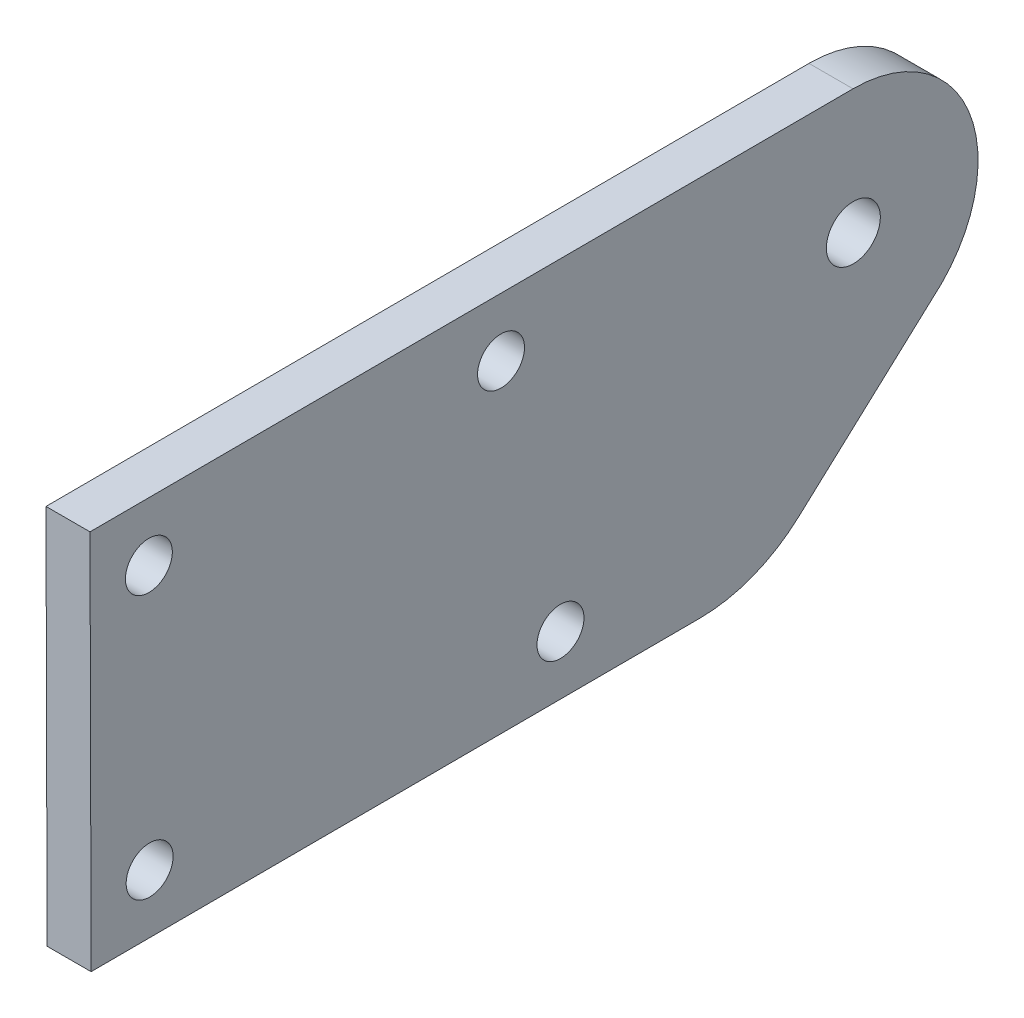
ISO-10303-21;
HEADER;
FILE_DESCRIPTION(('STEP AP214'),'2;1');
FILE_NAME('part.step','',(''),(''),'','','');
FILE_SCHEMA(('AUTOMOTIVE_DESIGN { 1 0 10303 214 1 1 1 1 }'));
ENDSEC;
DATA;
#1=APPLICATION_CONTEXT('core data for automotive mechanical design processes');
#2=APPLICATION_PROTOCOL_DEFINITION('international standard','automotive_design',2000,#1);
#3=PRODUCT_CONTEXT('',#1,'mechanical');
#4=PRODUCT('Part','Part','',(#3));
#5=PRODUCT_RELATED_PRODUCT_CATEGORY('part','',(#4));
#6=PRODUCT_DEFINITION_FORMATION('','',#4);
#7=PRODUCT_DEFINITION_CONTEXT('part definition',#1,'design');
#8=PRODUCT_DEFINITION('design','',#6,#7);
#9=PRODUCT_DEFINITION_SHAPE('','',#8);
#10=(LENGTH_UNIT() NAMED_UNIT(*) SI_UNIT(.MILLI.,.METRE.));
#11=(NAMED_UNIT(*) PLANE_ANGLE_UNIT() SI_UNIT($,.RADIAN.));
#12=(NAMED_UNIT(*) SI_UNIT($,.STERADIAN.) SOLID_ANGLE_UNIT());
#13=UNCERTAINTY_MEASURE_WITH_UNIT(LENGTH_MEASURE(1.E-05),#10,'distance_accuracy_value','');
#14=(GEOMETRIC_REPRESENTATION_CONTEXT(3) GLOBAL_UNCERTAINTY_ASSIGNED_CONTEXT((#13)) GLOBAL_UNIT_ASSIGNED_CONTEXT((#10,
#11,#12)) REPRESENTATION_CONTEXT('',''));
#15=CARTESIAN_POINT('',(0.,0.,0.));
#16=DIRECTION('',(0.,0.,1.));
#17=DIRECTION('',(1.,0.,0.));
#18=AXIS2_PLACEMENT_3D('',#15,#16,#17);
#19=CARTESIAN_POINT('',(3.,-0.106760715950999,-0.0387879175810517));
#20=DIRECTION('',(1.,0.,0.));
#21=DIRECTION('',(0.,0.,-1.));
#22=AXIS2_PLACEMENT_3D('',#19,#20,#21);
#23=PLANE('',#22);
#24=CARTESIAN_POINT('',(3.,-13.7446402422426,47.9222195992172));
#25=DIRECTION('',(1.,0.,0.));
#26=DIRECTION('',(0.,0.,-1.));
#27=AXIS2_PLACEMENT_3D('',#24,#25,#26);
#28=CIRCLE('',#27,1.59999999999998);
#29=CARTESIAN_POINT('',(3.,-13.7446402422426,46.3222195992172));
#30=VERTEX_POINT('',#29);
#31=EDGE_CURVE('E192',#30,#30,#28,.T.);
#32=ORIENTED_EDGE('',*,*,#31,.F.);
#33=EDGE_LOOP('',(#32));
#34=FACE_BOUND('',#33,.T.);
#35=CARTESIAN_POINT('',(3.,4.25528543675281,47.9739453243583));
#36=DIRECTION('',(1.,0.,0.));
#37=DIRECTION('',(0.,0.,-1.));
#38=AXIS2_PLACEMENT_3D('',#35,#36,#37);
#39=CIRCLE('',#38,1.60000000000002);
#40=CARTESIAN_POINT('',(3.,4.25528543675281,46.3739453243583));
#41=VERTEX_POINT('',#40);
#42=EDGE_CURVE('E204',#41,#41,#39,.T.);
#43=ORIENTED_EDGE('',*,*,#42,.F.);
#44=EDGE_LOOP('',(#43));
#45=FACE_BOUND('',#44,.T.);
#46=DIRECTION('',(0.,-0.00287365139677192,0.999995871055301));
#47=VECTOR('',#46,1.);
#48=CARTESIAN_POINT('',(3.,8.24377431538692,51.985423414167));
#49=LINE('',#48,#47);
#50=CARTESIAN_POINT('',(3.,8.39320418801906,-0.0143618807086011));
#51=VERTEX_POINT('',#50);
#52=CARTESIAN_POINT('',(3.,8.24377431538692,51.985423414167));
#53=VERTEX_POINT('',#52);
#54=EDGE_CURVE('E128',#51,#53,#49,.T.);
#55=ORIENTED_EDGE('',*,*,#54,.T.);
#56=DIRECTION('',(0.,-0.999995871055301,-0.00287365139675991));
#57=VECTOR('',#56,1.);
#58=CARTESIAN_POINT('',(3.,8.24377431538692,51.985423414167));
#59=LINE('',#58,#57);
#60=CARTESIAN_POINT('',(3.,-17.7561183320509,51.9107084778513));
#61=VERTEX_POINT('',#60);
#62=EDGE_CURVE('E86',#53,#61,#59,.T.);
#63=ORIENTED_EDGE('',*,*,#62,.T.);
#64=DIRECTION('',(0.,0.00287365139677199,-0.999995871055301));
#65=VECTOR('',#64,1.);
#66=CARTESIAN_POINT('',(3.,-17.7561183320509,51.9107084778513));
#67=LINE('',#66,#65);
#68=CARTESIAN_POINT('',(3.,-17.6368617990849,10.4108798290563));
#69=VERTEX_POINT('',#68);
#70=EDGE_CURVE('E99',#61,#69,#67,.T.);
#71=ORIENTED_EDGE('',*,*,#70,.T.);
#72=CARTESIAN_POINT('',(3.,-7.63690308853195,10.439616343024));
#73=DIRECTION('',(1.,0.,0.));
#74=DIRECTION('',(0.,0.,-1.));
#75=AXIS2_PLACEMENT_3D('',#72,#73,#74);
#76=CIRCLE('',#75,9.99999999999991);
#77=CARTESIAN_POINT('',(3.,-15.0193601103393,3.69429734973951));
#78=VERTEX_POINT('',#77);
#79=EDGE_CURVE('E93',#69,#78,#76,.T.);
#80=ORIENTED_EDGE('',*,*,#79,.T.);
#81=DIRECTION('',(0.,0.674531899328458,-0.738245702180746));
#82=VECTOR('',#81,1.);
#83=CARTESIAN_POINT('',(3.,-15.0193601103393,3.6942973497395));
#84=LINE('',#83,#82);
#85=CARTESIAN_POINT('',(3.,-6.11262214246682,-6.05373833512312));
#86=VERTEX_POINT('',#85);
#87=EDGE_CURVE('E97',#78,#86,#84,.T.);
#88=ORIENTED_EDGE('',*,*,#87,.T.);
#89=CARTESIAN_POINT('',(3.,-0.106760715950999,-0.0387879175810517));
#90=DIRECTION('',(1.,0.,0.));
#91=DIRECTION('',(0.,0.,-1.));
#92=AXIS2_PLACEMENT_3D('',#89,#90,#91);
#93=CIRCLE('',#92,8.50000000000001);
#94=EDGE_CURVE('E49',#86,#51,#93,.T.);
#95=ORIENTED_EDGE('',*,*,#94,.T.);
#96=EDGE_LOOP('',(#55,#63,#71,#80,#88,#95));
#97=FACE_BOUND('',#96,.T.);
#98=CARTESIAN_POINT('',(3.,-0.106760715950999,-0.0387879175810517));
#99=DIRECTION('',(1.,0.,0.));
#100=DIRECTION('',(0.,0.,-1.));
#101=AXIS2_PLACEMENT_3D('',#98,#99,#100);
#102=CIRCLE('',#101,1.8398838408401);
#103=CARTESIAN_POINT('',(3.,-0.106760715950999,-1.87867175842115));
#104=VERTEX_POINT('',#103);
#105=EDGE_CURVE('E121',#104,#104,#102,.T.);
#106=ORIENTED_EDGE('',*,*,#105,.F.);
#107=EDGE_LOOP('',(#106));
#108=FACE_BOUND('',#107,.T.);
#109=CARTESIAN_POINT('',(3.,4.32425307027479,23.9740444190311));
#110=DIRECTION('',(1.,0.,0.));
#111=DIRECTION('',(0.,0.,-1.));
#112=AXIS2_PLACEMENT_3D('',#109,#110,#111);
#113=CIRCLE('',#112,1.60000000000002);
#114=CARTESIAN_POINT('',(3.,4.32425307027479,22.3740444190311));
#115=VERTEX_POINT('',#114);
#116=EDGE_CURVE('E198',#115,#115,#113,.T.);
#117=ORIENTED_EDGE('',*,*,#116,.F.);
#118=EDGE_LOOP('',(#117));
#119=FACE_BOUND('',#118,.T.);
#120=CARTESIAN_POINT('',(3.,-13.664178003133,19.9223352096688));
#121=DIRECTION('',(1.,0.,0.));
#122=DIRECTION('',(0.,0.,-1.));
#123=AXIS2_PLACEMENT_3D('',#120,#121,#122);
#124=CIRCLE('',#123,1.59999999999999);
#125=CARTESIAN_POINT('',(3.,-13.664178003133,18.3223352096688));
#126=VERTEX_POINT('',#125);
#127=EDGE_CURVE('E183',#126,#126,#124,.T.);
#128=ORIENTED_EDGE('',*,*,#127,.F.);
#129=EDGE_LOOP('',(#128));
#130=FACE_BOUND('',#129,.T.);
#131=ADVANCED_FACE('F32',(#34,#45,#97,#108,#119,#130),#23,.T.);
#132=CARTESIAN_POINT('',(0.,-0.106760715950999,-0.0387879175810517));
#133=DIRECTION('',(1.,0.,0.));
#134=DIRECTION('',(0.,0.,-1.));
#135=AXIS2_PLACEMENT_3D('',#132,#133,#134);
#136=PLANE('',#135);
#137=DIRECTION('',(0.,-0.00287365139677192,0.999995871055301));
#138=VECTOR('',#137,1.);
#139=CARTESIAN_POINT('',(0.,8.24377431538692,51.985423414167));
#140=LINE('',#139,#138);
#141=CARTESIAN_POINT('',(0.,8.39320418801906,-0.0143618807086011));
#142=VERTEX_POINT('',#141);
#143=CARTESIAN_POINT('',(0.,8.24377431538692,51.985423414167));
#144=VERTEX_POINT('',#143);
#145=EDGE_CURVE('E117',#142,#144,#140,.T.);
#146=ORIENTED_EDGE('',*,*,#145,.F.);
#147=CARTESIAN_POINT('',(0.,-0.106760715950999,-0.0387879175810517));
#148=DIRECTION('',(1.,0.,0.));
#149=DIRECTION('',(0.,0.,-1.));
#150=AXIS2_PLACEMENT_3D('',#147,#148,#149);
#151=CIRCLE('',#150,8.50000000000001);
#152=CARTESIAN_POINT('',(0.,-6.11262214246682,-6.05373833512312));
#153=VERTEX_POINT('',#152);
#154=EDGE_CURVE('E78',#153,#142,#151,.T.);
#155=ORIENTED_EDGE('',*,*,#154,.F.);
#156=DIRECTION('',(0.,0.674531899328458,-0.738245702180746));
#157=VECTOR('',#156,1.);
#158=CARTESIAN_POINT('',(0.,-15.0193601103393,3.6942973497395));
#159=LINE('',#158,#157);
#160=CARTESIAN_POINT('',(0.,-15.0193601103393,3.69429734973951));
#161=VERTEX_POINT('',#160);
#162=EDGE_CURVE('E72',#161,#153,#159,.T.);
#163=ORIENTED_EDGE('',*,*,#162,.F.);
#164=CARTESIAN_POINT('',(0.,-7.63690308853195,10.439616343024));
#165=DIRECTION('',(1.,0.,0.));
#166=DIRECTION('',(0.,0.,-1.));
#167=AXIS2_PLACEMENT_3D('',#164,#165,#166);
#168=CIRCLE('',#167,9.99999999999991);
#169=CARTESIAN_POINT('',(0.,-17.6368617990849,10.4108798290563));
#170=VERTEX_POINT('',#169);
#171=EDGE_CURVE('E107',#170,#161,#168,.T.);
#172=ORIENTED_EDGE('',*,*,#171,.F.);
#173=DIRECTION('',(0.,0.00287365139677199,-0.999995871055301));
#174=VECTOR('',#173,1.);
#175=CARTESIAN_POINT('',(0.,-17.7561183320509,51.9107084778513));
#176=LINE('',#175,#174);
#177=CARTESIAN_POINT('',(0.,-17.7561183320509,51.9107084778513));
#178=VERTEX_POINT('',#177);
#179=EDGE_CURVE('E123',#178,#170,#176,.T.);
#180=ORIENTED_EDGE('',*,*,#179,.F.);
#181=DIRECTION('',(0.,-0.999995871055301,-0.00287365139675991));
#182=VECTOR('',#181,1.);
#183=CARTESIAN_POINT('',(0.,8.24377431538692,51.985423414167));
#184=LINE('',#183,#182);
#185=EDGE_CURVE('E120',#144,#178,#184,.T.);
#186=ORIENTED_EDGE('',*,*,#185,.F.);
#187=EDGE_LOOP('',(#146,#155,#163,#172,#180,#186));
#188=FACE_BOUND('',#187,.T.);
#189=CARTESIAN_POINT('',(0.,-0.106760715950999,-0.0387879175810517));
#190=DIRECTION('',(1.,0.,0.));
#191=DIRECTION('',(0.,0.,-1.));
#192=AXIS2_PLACEMENT_3D('',#189,#190,#191);
#193=CIRCLE('',#192,1.8398838408401);
#194=CARTESIAN_POINT('',(0.,-0.106760715950999,-1.87867175842115));
#195=VERTEX_POINT('',#194);
#196=EDGE_CURVE('E207',#195,#195,#193,.T.);
#197=ORIENTED_EDGE('',*,*,#196,.T.);
#198=EDGE_LOOP('',(#197));
#199=FACE_BOUND('',#198,.T.);
#200=CARTESIAN_POINT('',(0.,4.25528543675281,47.9739453243583));
#201=DIRECTION('',(1.,0.,0.));
#202=DIRECTION('',(0.,0.,-1.));
#203=AXIS2_PLACEMENT_3D('',#200,#201,#202);
#204=CIRCLE('',#203,1.60000000000002);
#205=CARTESIAN_POINT('',(0.,4.25528543675281,46.3739453243583));
#206=VERTEX_POINT('',#205);
#207=EDGE_CURVE('E201',#206,#206,#204,.T.);
#208=ORIENTED_EDGE('',*,*,#207,.T.);
#209=EDGE_LOOP('',(#208));
#210=FACE_BOUND('',#209,.T.);
#211=CARTESIAN_POINT('',(0.,4.32425307027479,23.9740444190311));
#212=DIRECTION('',(1.,0.,0.));
#213=DIRECTION('',(0.,0.,-1.));
#214=AXIS2_PLACEMENT_3D('',#211,#212,#213);
#215=CIRCLE('',#214,1.60000000000002);
#216=CARTESIAN_POINT('',(0.,4.32425307027479,22.3740444190311));
#217=VERTEX_POINT('',#216);
#218=EDGE_CURVE('E195',#217,#217,#215,.T.);
#219=ORIENTED_EDGE('',*,*,#218,.T.);
#220=EDGE_LOOP('',(#219));
#221=FACE_BOUND('',#220,.T.);
#222=CARTESIAN_POINT('',(0.,-13.7446402422426,47.9222195992172));
#223=DIRECTION('',(1.,0.,0.));
#224=DIRECTION('',(0.,0.,-1.));
#225=AXIS2_PLACEMENT_3D('',#222,#223,#224);
#226=CIRCLE('',#225,1.59999999999998);
#227=CARTESIAN_POINT('',(0.,-13.7446402422426,46.3222195992172));
#228=VERTEX_POINT('',#227);
#229=EDGE_CURVE('E189',#228,#228,#226,.T.);
#230=ORIENTED_EDGE('',*,*,#229,.T.);
#231=EDGE_LOOP('',(#230));
#232=FACE_BOUND('',#231,.T.);
#233=CARTESIAN_POINT('',(0.,-13.664178003133,19.9223352096688));
#234=DIRECTION('',(1.,0.,0.));
#235=DIRECTION('',(0.,0.,-1.));
#236=AXIS2_PLACEMENT_3D('',#233,#234,#235);
#237=CIRCLE('',#236,1.59999999999999);
#238=CARTESIAN_POINT('',(0.,-13.664178003133,18.3223352096688));
#239=VERTEX_POINT('',#238);
#240=EDGE_CURVE('E186',#239,#239,#237,.T.);
#241=ORIENTED_EDGE('',*,*,#240,.T.);
#242=EDGE_LOOP('',(#241));
#243=FACE_BOUND('',#242,.T.);
#244=ADVANCED_FACE('F137',(#188,#199,#210,#221,#232,#243),#136,.F.);
#245=CARTESIAN_POINT('',(3.,8.24377431538692,51.985423414167));
#246=DIRECTION('',(0.,-0.999995871055301,-0.00287365139677192));
#247=DIRECTION('',(0.,0.00287365139677192,-0.999995871055301));
#248=AXIS2_PLACEMENT_3D('',#245,#246,#247);
#249=PLANE('',#248);
#250=ORIENTED_EDGE('',*,*,#145,.T.);
#251=DIRECTION('',(-1.,0.,0.));
#252=VECTOR('',#251,1.);
#253=CARTESIAN_POINT('',(3.,8.24377431538692,51.985423414167));
#254=LINE('',#253,#252);
#255=EDGE_CURVE('E11',#53,#144,#254,.T.);
#256=ORIENTED_EDGE('',*,*,#255,.F.);
#257=ORIENTED_EDGE('',*,*,#54,.F.);
#258=DIRECTION('',(-1.,0.,0.));
#259=VECTOR('',#258,1.);
#260=CARTESIAN_POINT('',(3.,8.39320418801906,-0.0143618807086011));
#261=LINE('',#260,#259);
#262=EDGE_CURVE('E113',#51,#142,#261,.T.);
#263=ORIENTED_EDGE('',*,*,#262,.T.);
#264=EDGE_LOOP('',(#250,#256,#257,#263));
#265=FACE_BOUND('',#264,.T.);
#266=ADVANCED_FACE('F34',(#265),#249,.F.);
#267=CARTESIAN_POINT('',(3.,8.24377431538692,51.985423414167));
#268=DIRECTION('',(0.,0.00287365139675991,-0.999995871055301));
#269=DIRECTION('',(0.,0.999995871055301,0.00287365139675991));
#270=AXIS2_PLACEMENT_3D('',#267,#268,#269);
#271=PLANE('',#270);
#272=ORIENTED_EDGE('',*,*,#185,.T.);
#273=DIRECTION('',(-1.,0.,0.));
#274=VECTOR('',#273,1.);
#275=CARTESIAN_POINT('',(3.,-17.7561183320509,51.9107084778513));
#276=LINE('',#275,#274);
#277=EDGE_CURVE('E41',#61,#178,#276,.T.);
#278=ORIENTED_EDGE('',*,*,#277,.F.);
#279=ORIENTED_EDGE('',*,*,#62,.F.);
#280=ORIENTED_EDGE('',*,*,#255,.T.);
#281=EDGE_LOOP('',(#272,#278,#279,#280));
#282=FACE_BOUND('',#281,.T.);
#283=ADVANCED_FACE('F274',(#282),#271,.F.);
#284=CARTESIAN_POINT('',(3.,-17.7561183320509,51.9107084778513));
#285=DIRECTION('',(0.,0.999995871055301,0.00287365139677199));
#286=DIRECTION('',(0.,-0.00287365139677199,0.999995871055301));
#287=AXIS2_PLACEMENT_3D('',#284,#285,#286);
#288=PLANE('',#287);
#289=ORIENTED_EDGE('',*,*,#179,.T.);
#290=DIRECTION('',(-1.,0.,0.));
#291=VECTOR('',#290,1.);
#292=CARTESIAN_POINT('',(3.,-17.6368617990849,10.4108798290563));
#293=LINE('',#292,#291);
#294=EDGE_CURVE('E108',#69,#170,#293,.T.);
#295=ORIENTED_EDGE('',*,*,#294,.F.);
#296=ORIENTED_EDGE('',*,*,#70,.F.);
#297=ORIENTED_EDGE('',*,*,#277,.T.);
#298=EDGE_LOOP('',(#289,#295,#296,#297));
#299=FACE_BOUND('',#298,.T.);
#300=ADVANCED_FACE('F134',(#299),#288,.F.);
#301=CARTESIAN_POINT('',(3.,-7.63690308853195,10.439616343024));
#302=DIRECTION('',(-1.,0.,0.));
#303=DIRECTION('',(0.,0.,1.));
#304=AXIS2_PLACEMENT_3D('',#301,#302,#303);
#305=CYLINDRICAL_SURFACE('',#304,9.99999999999991);
#306=ORIENTED_EDGE('',*,*,#171,.T.);
#307=DIRECTION('',(-1.,0.,0.));
#308=VECTOR('',#307,1.);
#309=CARTESIAN_POINT('',(3.,-15.0193601103393,3.69429734973951));
#310=LINE('',#309,#308);
#311=EDGE_CURVE('E104',#78,#161,#310,.T.);
#312=ORIENTED_EDGE('',*,*,#311,.F.);
#313=ORIENTED_EDGE('',*,*,#79,.F.);
#314=ORIENTED_EDGE('',*,*,#294,.T.);
#315=EDGE_LOOP('',(#306,#312,#313,#314));
#316=FACE_BOUND('',#315,.T.);
#317=ADVANCED_FACE('F105',(#316),#305,.T.);
#318=CARTESIAN_POINT('',(3.,-15.0193601103393,3.6942973497395));
#319=DIRECTION('',(0.,0.738245702180746,0.674531899328458));
#320=DIRECTION('',(0.,-0.674531899328458,0.738245702180746));
#321=AXIS2_PLACEMENT_3D('',#318,#319,#320);
#322=PLANE('',#321);
#323=ORIENTED_EDGE('',*,*,#162,.T.);
#324=DIRECTION('',(-1.,0.,0.));
#325=VECTOR('',#324,1.);
#326=CARTESIAN_POINT('',(3.,-6.11262214246682,-6.05373833512312));
#327=LINE('',#326,#325);
#328=EDGE_CURVE('E109',#86,#153,#327,.T.);
#329=ORIENTED_EDGE('',*,*,#328,.F.);
#330=ORIENTED_EDGE('',*,*,#87,.F.);
#331=ORIENTED_EDGE('',*,*,#311,.T.);
#332=EDGE_LOOP('',(#323,#329,#330,#331));
#333=FACE_BOUND('',#332,.T.);
#334=ADVANCED_FACE('F111',(#333),#322,.F.);
#335=CARTESIAN_POINT('',(3.,-0.106760715950999,-0.0387879175810517));
#336=DIRECTION('',(-1.,0.,0.));
#337=DIRECTION('',(0.,0.,1.));
#338=AXIS2_PLACEMENT_3D('',#335,#336,#337);
#339=CYLINDRICAL_SURFACE('',#338,8.50000000000001);
#340=ORIENTED_EDGE('',*,*,#154,.T.);
#341=ORIENTED_EDGE('',*,*,#262,.F.);
#342=ORIENTED_EDGE('',*,*,#94,.F.);
#343=ORIENTED_EDGE('',*,*,#328,.T.);
#344=EDGE_LOOP('',(#340,#341,#342,#343));
#345=FACE_BOUND('',#344,.T.);
#346=ADVANCED_FACE('F142',(#345),#339,.T.);
#347=CARTESIAN_POINT('',(3.,-0.106760715950999,-0.0387879175810517));
#348=DIRECTION('',(-1.,0.,0.));
#349=DIRECTION('',(0.,0.,1.));
#350=AXIS2_PLACEMENT_3D('',#347,#348,#349);
#351=CYLINDRICAL_SURFACE('',#350,1.8398838408401);
#352=ORIENTED_EDGE('',*,*,#105,.T.);
#353=EDGE_LOOP('',(#352));
#354=FACE_BOUND('',#353,.T.);
#355=ORIENTED_EDGE('',*,*,#196,.F.);
#356=EDGE_LOOP('',(#355));
#357=FACE_BOUND('',#356,.T.);
#358=ADVANCED_FACE('F144',(#354,#357),#351,.F.);
#359=CARTESIAN_POINT('',(3.,4.25528543675281,47.9739453243583));
#360=DIRECTION('',(-1.,0.,0.));
#361=DIRECTION('',(0.,0.,1.));
#362=AXIS2_PLACEMENT_3D('',#359,#360,#361);
#363=CYLINDRICAL_SURFACE('',#362,1.60000000000002);
#364=ORIENTED_EDGE('',*,*,#42,.T.);
#365=EDGE_LOOP('',(#364));
#366=FACE_BOUND('',#365,.T.);
#367=ORIENTED_EDGE('',*,*,#207,.F.);
#368=EDGE_LOOP('',(#367));
#369=FACE_BOUND('',#368,.T.);
#370=ADVANCED_FACE('F150',(#366,#369),#363,.F.);
#371=CARTESIAN_POINT('',(3.,4.32425307027479,23.9740444190311));
#372=DIRECTION('',(-1.,0.,0.));
#373=DIRECTION('',(0.,0.,1.));
#374=AXIS2_PLACEMENT_3D('',#371,#372,#373);
#375=CYLINDRICAL_SURFACE('',#374,1.60000000000002);
#376=ORIENTED_EDGE('',*,*,#116,.T.);
#377=EDGE_LOOP('',(#376));
#378=FACE_BOUND('',#377,.T.);
#379=ORIENTED_EDGE('',*,*,#218,.F.);
#380=EDGE_LOOP('',(#379));
#381=FACE_BOUND('',#380,.T.);
#382=ADVANCED_FACE('F166',(#378,#381),#375,.F.);
#383=CARTESIAN_POINT('',(3.,-13.7446402422426,47.9222195992172));
#384=DIRECTION('',(-1.,0.,0.));
#385=DIRECTION('',(0.,0.,1.));
#386=AXIS2_PLACEMENT_3D('',#383,#384,#385);
#387=CYLINDRICAL_SURFACE('',#386,1.59999999999998);
#388=ORIENTED_EDGE('',*,*,#31,.T.);
#389=EDGE_LOOP('',(#388));
#390=FACE_BOUND('',#389,.T.);
#391=ORIENTED_EDGE('',*,*,#229,.F.);
#392=EDGE_LOOP('',(#391));
#393=FACE_BOUND('',#392,.T.);
#394=ADVANCED_FACE('F170',(#390,#393),#387,.F.);
#395=CARTESIAN_POINT('',(3.,-13.664178003133,19.9223352096688));
#396=DIRECTION('',(-1.,0.,0.));
#397=DIRECTION('',(0.,0.,1.));
#398=AXIS2_PLACEMENT_3D('',#395,#396,#397);
#399=CYLINDRICAL_SURFACE('',#398,1.59999999999999);
#400=ORIENTED_EDGE('',*,*,#127,.T.);
#401=EDGE_LOOP('',(#400));
#402=FACE_BOUND('',#401,.T.);
#403=ORIENTED_EDGE('',*,*,#240,.F.);
#404=EDGE_LOOP('',(#403));
#405=FACE_BOUND('',#404,.T.);
#406=ADVANCED_FACE('F174',(#402,#405),#399,.F.);
#407=CLOSED_SHELL('',(#131,#244,#266,#283,#300,#317,#334,#346,#358,#370,#382,#394,#406));
#408=MANIFOLD_SOLID_BREP('B2',#407);
#409=ADVANCED_BREP_SHAPE_REPRESENTATION('',(#18,#408),#14);
#410=SHAPE_DEFINITION_REPRESENTATION(#9,#409);
ENDSEC;
END-ISO-10303-21;
